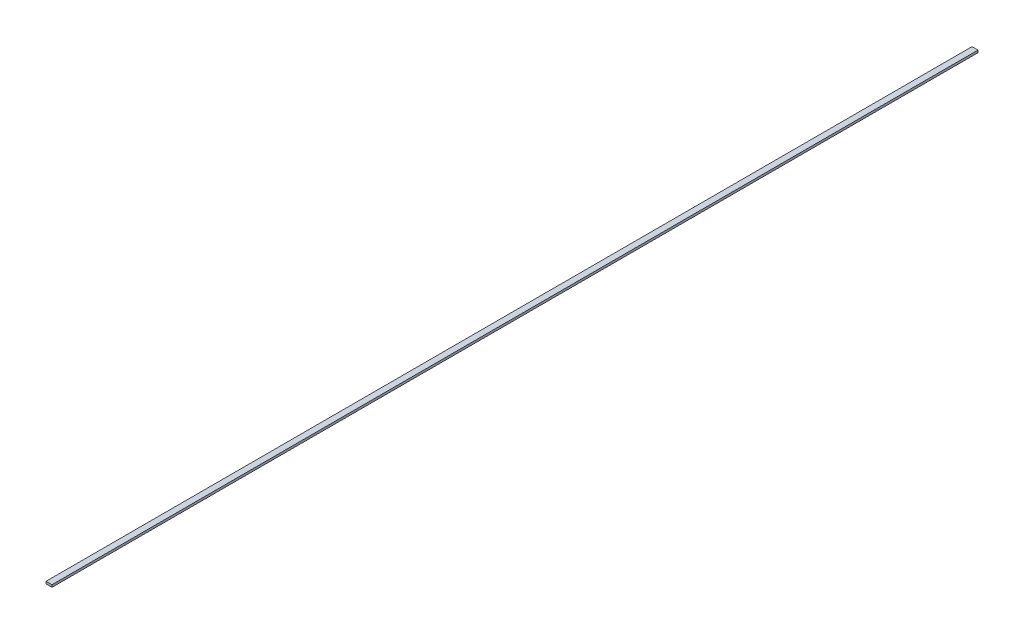
ISO-10303-21;
HEADER;
FILE_DESCRIPTION(('STEP AP214'),'2;1');
FILE_NAME('part.step','',(''),(''),'','','');
FILE_SCHEMA(('AUTOMOTIVE_DESIGN { 1 0 10303 214 1 1 1 1 }'));
ENDSEC;
DATA;
#1=APPLICATION_CONTEXT('core data for automotive mechanical design processes');
#2=APPLICATION_PROTOCOL_DEFINITION('international standard','automotive_design',2000,#1);
#3=PRODUCT_CONTEXT('',#1,'mechanical');
#4=PRODUCT('Part','Part','',(#3));
#5=PRODUCT_RELATED_PRODUCT_CATEGORY('part','',(#4));
#6=PRODUCT_DEFINITION_FORMATION('','',#4);
#7=PRODUCT_DEFINITION_CONTEXT('part definition',#1,'design');
#8=PRODUCT_DEFINITION('design','',#6,#7);
#9=PRODUCT_DEFINITION_SHAPE('','',#8);
#10=(LENGTH_UNIT() NAMED_UNIT(*) SI_UNIT(.MILLI.,.METRE.));
#11=(NAMED_UNIT(*) PLANE_ANGLE_UNIT() SI_UNIT($,.RADIAN.));
#12=(NAMED_UNIT(*) SI_UNIT($,.STERADIAN.) SOLID_ANGLE_UNIT());
#13=UNCERTAINTY_MEASURE_WITH_UNIT(LENGTH_MEASURE(1.E-05),#10,'distance_accuracy_value','');
#14=(GEOMETRIC_REPRESENTATION_CONTEXT(3) GLOBAL_UNCERTAINTY_ASSIGNED_CONTEXT((#13)) GLOBAL_UNIT_ASSIGNED_CONTEXT((#10,
#11,#12)) REPRESENTATION_CONTEXT('',''));
#15=CARTESIAN_POINT('',(0.,0.,0.));
#16=DIRECTION('',(0.,0.,1.));
#17=DIRECTION('',(1.,0.,0.));
#18=AXIS2_PLACEMENT_3D('',#15,#16,#17);
#19=CARTESIAN_POINT('',(-0.0649999999999988,0.05,-10.0925));
#20=DIRECTION('',(1.,0.,0.));
#21=DIRECTION('',(0.,0.,-1.));
#22=AXIS2_PLACEMENT_3D('',#19,#20,#21);
#23=PLANE('',#22);
#24=DIRECTION('',(0.,0.,1.));
#25=VECTOR('',#24,1.);
#26=CARTESIAN_POINT('',(-0.0649999999999988,0.,-10.0925));
#27=LINE('',#26,#25);
#28=CARTESIAN_POINT('',(-0.0649999999999988,0.,-10.0925));
#29=VERTEX_POINT('',#28);
#30=CARTESIAN_POINT('',(-0.0649999999999988,0.,10.0925));
#31=VERTEX_POINT('',#30);
#32=EDGE_CURVE('E97',#29,#31,#27,.T.);
#33=ORIENTED_EDGE('',*,*,#32,.T.);
#34=DIRECTION('',(0.,-1.,0.));
#35=VECTOR('',#34,1.);
#36=CARTESIAN_POINT('',(-0.0649999999999988,0.05,10.0925));
#37=LINE('',#36,#35);
#38=CARTESIAN_POINT('',(-0.0649999999999988,0.05,10.0925));
#39=VERTEX_POINT('',#38);
#40=EDGE_CURVE('E11',#39,#31,#37,.T.);
#41=ORIENTED_EDGE('',*,*,#40,.F.);
#42=DIRECTION('',(0.,0.,1.));
#43=VECTOR('',#42,1.);
#44=CARTESIAN_POINT('',(-0.0649999999999988,0.05,-10.0925));
#45=LINE('',#44,#43);
#46=CARTESIAN_POINT('',(-0.0649999999999988,0.05,-10.0925));
#47=VERTEX_POINT('',#46);
#48=EDGE_CURVE('E85',#47,#39,#45,.T.);
#49=ORIENTED_EDGE('',*,*,#48,.F.);
#50=DIRECTION('',(0.,-1.,0.));
#51=VECTOR('',#50,1.);
#52=CARTESIAN_POINT('',(-0.0649999999999988,0.05,-10.0925));
#53=LINE('',#52,#51);
#54=EDGE_CURVE('E93',#47,#29,#53,.T.);
#55=ORIENTED_EDGE('',*,*,#54,.T.);
#56=EDGE_LOOP('',(#33,#41,#49,#55));
#57=FACE_BOUND('',#56,.T.);
#58=ADVANCED_FACE('F34',(#57),#23,.F.);
#59=CARTESIAN_POINT('',(-0.0649999999999988,0.05,10.0925));
#60=DIRECTION('',(0.,0.,-1.));
#61=DIRECTION('',(-1.,0.,0.));
#62=AXIS2_PLACEMENT_3D('',#59,#60,#61);
#63=PLANE('',#62);
#64=DIRECTION('',(1.,0.,0.));
#65=VECTOR('',#64,1.);
#66=CARTESIAN_POINT('',(-0.0649999999999988,0.,10.0925));
#67=LINE('',#66,#65);
#68=CARTESIAN_POINT('',(0.0650000000000013,0.,10.0925));
#69=VERTEX_POINT('',#68);
#70=EDGE_CURVE('E89',#31,#69,#67,.T.);
#71=ORIENTED_EDGE('',*,*,#70,.T.);
#72=DIRECTION('',(0.,-1.,0.));
#73=VECTOR('',#72,1.);
#74=CARTESIAN_POINT('',(0.0650000000000013,0.05,10.0925));
#75=LINE('',#74,#73);
#76=CARTESIAN_POINT('',(0.0650000000000013,0.05,10.0925));
#77=VERTEX_POINT('',#76);
#78=EDGE_CURVE('E42',#77,#69,#75,.T.);
#79=ORIENTED_EDGE('',*,*,#78,.F.);
#80=DIRECTION('',(1.,0.,0.));
#81=VECTOR('',#80,1.);
#82=CARTESIAN_POINT('',(-0.0649999999999988,0.05,10.0925));
#83=LINE('',#82,#81);
#84=EDGE_CURVE('E80',#39,#77,#83,.T.);
#85=ORIENTED_EDGE('',*,*,#84,.F.);
#86=ORIENTED_EDGE('',*,*,#40,.T.);
#87=EDGE_LOOP('',(#71,#79,#85,#86));
#88=FACE_BOUND('',#87,.T.);
#89=ADVANCED_FACE('F88',(#88),#63,.F.);
#90=CARTESIAN_POINT('',(0.0650000000000012,0.05,-10.0925));
#91=DIRECTION('',(-1.,0.,0.));
#92=DIRECTION('',(0.,0.,1.));
#93=AXIS2_PLACEMENT_3D('',#90,#91,#92);
#94=PLANE('',#93);
#95=DIRECTION('',(0.,0.,-1.));
#96=VECTOR('',#95,1.);
#97=CARTESIAN_POINT('',(0.0650000000000012,0.,-10.0925));
#98=LINE('',#97,#96);
#99=CARTESIAN_POINT('',(0.0650000000000012,0.,-10.0925));
#100=VERTEX_POINT('',#99);
#101=EDGE_CURVE('E67',#69,#100,#98,.T.);
#102=ORIENTED_EDGE('',*,*,#101,.T.);
#103=DIRECTION('',(0.,-1.,0.));
#104=VECTOR('',#103,1.);
#105=CARTESIAN_POINT('',(0.0650000000000012,0.05,-10.0925));
#106=LINE('',#105,#104);
#107=CARTESIAN_POINT('',(0.0650000000000012,0.05,-10.0925));
#108=VERTEX_POINT('',#107);
#109=EDGE_CURVE('E90',#108,#100,#106,.T.);
#110=ORIENTED_EDGE('',*,*,#109,.F.);
#111=DIRECTION('',(0.,0.,-1.));
#112=VECTOR('',#111,1.);
#113=CARTESIAN_POINT('',(0.0650000000000012,0.05,-10.0925));
#114=LINE('',#113,#112);
#115=EDGE_CURVE('E83',#77,#108,#114,.T.);
#116=ORIENTED_EDGE('',*,*,#115,.F.);
#117=ORIENTED_EDGE('',*,*,#78,.T.);
#118=EDGE_LOOP('',(#102,#110,#116,#117));
#119=FACE_BOUND('',#118,.T.);
#120=ADVANCED_FACE('F91',(#119),#94,.F.);
#121=CARTESIAN_POINT('',(-0.0649999999999988,0.05,-10.0925));
#122=DIRECTION('',(0.,0.,1.));
#123=DIRECTION('',(1.,0.,0.));
#124=AXIS2_PLACEMENT_3D('',#121,#122,#123);
#125=PLANE('',#124);
#126=DIRECTION('',(-1.,0.,0.));
#127=VECTOR('',#126,1.);
#128=CARTESIAN_POINT('',(-0.0649999999999988,0.,-10.0925));
#129=LINE('',#128,#127);
#130=EDGE_CURVE('E73',#100,#29,#129,.T.);
#131=ORIENTED_EDGE('',*,*,#130,.T.);
#132=ORIENTED_EDGE('',*,*,#54,.F.);
#133=DIRECTION('',(-1.,0.,0.));
#134=VECTOR('',#133,1.);
#135=CARTESIAN_POINT('',(-0.0649999999999988,0.05,-10.0925));
#136=LINE('',#135,#134);
#137=EDGE_CURVE('E50',#108,#47,#136,.T.);
#138=ORIENTED_EDGE('',*,*,#137,.F.);
#139=ORIENTED_EDGE('',*,*,#109,.T.);
#140=EDGE_LOOP('',(#131,#132,#138,#139));
#141=FACE_BOUND('',#140,.T.);
#142=ADVANCED_FACE('F104',(#141),#125,.F.);
#143=CARTESIAN_POINT('',(-0.0649999999999988,0.05,10.0925));
#144=DIRECTION('',(0.,1.,0.));
#145=DIRECTION('',(0.,0.,1.));
#146=AXIS2_PLACEMENT_3D('',#143,#144,#145);
#147=PLANE('',#146);
#148=ORIENTED_EDGE('',*,*,#48,.T.);
#149=ORIENTED_EDGE('',*,*,#84,.T.);
#150=ORIENTED_EDGE('',*,*,#115,.T.);
#151=ORIENTED_EDGE('',*,*,#137,.T.);
#152=EDGE_LOOP('',(#148,#149,#150,#151));
#153=FACE_BOUND('',#152,.T.);
#154=ADVANCED_FACE('F81',(#153),#147,.T.);
#155=CARTESIAN_POINT('',(-0.0649999999999988,0.,10.0925));
#156=DIRECTION('',(0.,1.,0.));
#157=DIRECTION('',(0.,0.,1.));
#158=AXIS2_PLACEMENT_3D('',#155,#156,#157);
#159=PLANE('',#158);
#160=ORIENTED_EDGE('',*,*,#32,.F.);
#161=ORIENTED_EDGE('',*,*,#130,.F.);
#162=ORIENTED_EDGE('',*,*,#101,.F.);
#163=ORIENTED_EDGE('',*,*,#70,.F.);
#164=EDGE_LOOP('',(#160,#161,#162,#163));
#165=FACE_BOUND('',#164,.T.);
#166=ADVANCED_FACE('F107',(#165),#159,.F.);
#167=CLOSED_SHELL('',(#58,#89,#120,#142,#154,#166));
#168=MANIFOLD_SOLID_BREP('B2',#167);
#169=ADVANCED_BREP_SHAPE_REPRESENTATION('',(#18,#168),#14);
#170=SHAPE_DEFINITION_REPRESENTATION(#9,#169);
ENDSEC;
END-ISO-10303-21;
